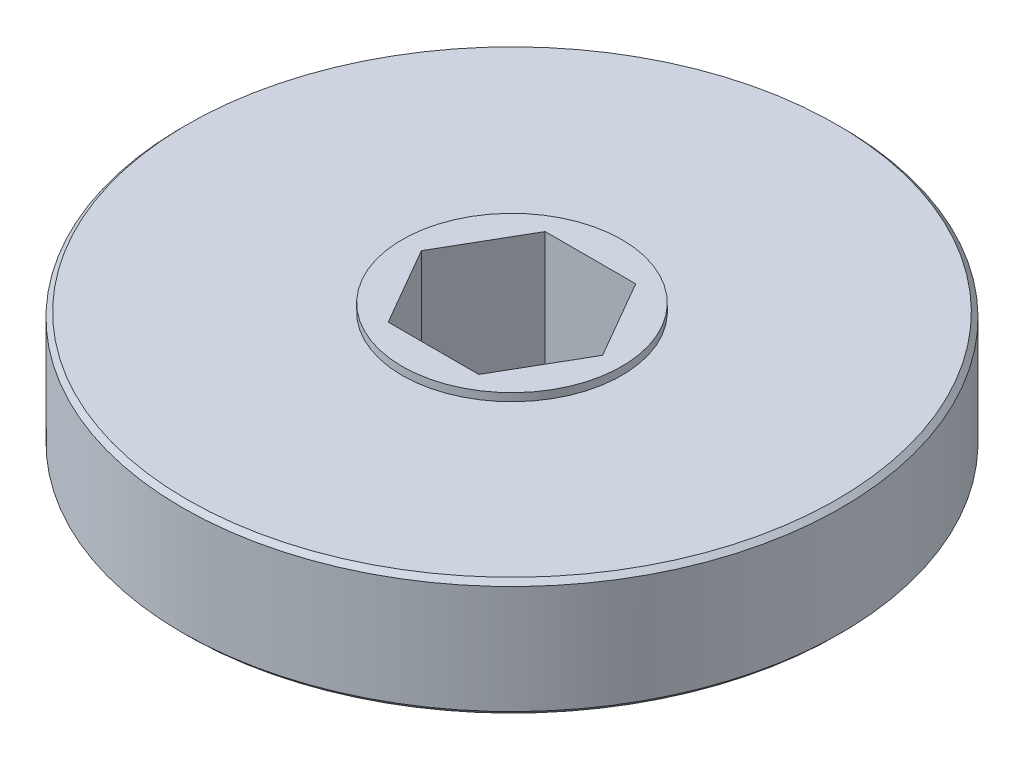
ISO-10303-21;
HEADER;
FILE_DESCRIPTION(('STEP AP214'),'2;1');
FILE_NAME('part.step','',(''),(''),'','','');
FILE_SCHEMA(('AUTOMOTIVE_DESIGN { 1 0 10303 214 1 1 1 1 }'));
ENDSEC;
DATA;
#1=APPLICATION_CONTEXT('core data for automotive mechanical design processes');
#2=APPLICATION_PROTOCOL_DEFINITION('international standard','automotive_design',2000,#1);
#3=PRODUCT_CONTEXT('',#1,'mechanical');
#4=PRODUCT('Part','Part','',(#3));
#5=PRODUCT_RELATED_PRODUCT_CATEGORY('part','',(#4));
#6=PRODUCT_DEFINITION_FORMATION('','',#4);
#7=PRODUCT_DEFINITION_CONTEXT('part definition',#1,'design');
#8=PRODUCT_DEFINITION('design','',#6,#7);
#9=PRODUCT_DEFINITION_SHAPE('','',#8);
#10=(LENGTH_UNIT() NAMED_UNIT(*) SI_UNIT(.MILLI.,.METRE.));
#11=(NAMED_UNIT(*) PLANE_ANGLE_UNIT() SI_UNIT($,.RADIAN.));
#12=(NAMED_UNIT(*) SI_UNIT($,.STERADIAN.) SOLID_ANGLE_UNIT());
#13=UNCERTAINTY_MEASURE_WITH_UNIT(LENGTH_MEASURE(1.E-05),#10,'distance_accuracy_value','');
#14=(GEOMETRIC_REPRESENTATION_CONTEXT(3) GLOBAL_UNCERTAINTY_ASSIGNED_CONTEXT((#13)) GLOBAL_UNIT_ASSIGNED_CONTEXT((#10,
#11,#12)) REPRESENTATION_CONTEXT('',''));
#15=CARTESIAN_POINT('',(0.,0.,0.));
#16=DIRECTION('',(0.,0.,1.));
#17=DIRECTION('',(1.,0.,0.));
#18=AXIS2_PLACEMENT_3D('',#15,#16,#17);
#19=CARTESIAN_POINT('',(0.,-10.16,0.));
#20=DIRECTION('',(0.,1.,0.));
#21=DIRECTION('',(0.,0.,1.));
#22=AXIS2_PLACEMENT_3D('',#19,#20,#21);
#23=CYLINDRICAL_SURFACE('',#22,26.67);
#24=CARTESIAN_POINT('',(0.,-9.77900000000004,0.));
#25=DIRECTION('',(0.,-1.,0.));
#26=DIRECTION('',(0.,0.,-1.));
#27=AXIS2_PLACEMENT_3D('',#24,#25,#26);
#28=CIRCLE('',#27,26.67);
#29=CARTESIAN_POINT('',(0.,-9.77900000000004,-26.67));
#30=VERTEX_POINT('',#29);
#31=EDGE_CURVE('E149',#30,#30,#28,.F.);
#32=ORIENTED_EDGE('',*,*,#31,.T.);
#33=EDGE_LOOP('',(#32));
#34=FACE_BOUND('',#33,.T.);
#35=CARTESIAN_POINT('',(0.,-1.016,0.));
#36=DIRECTION('',(0.,1.,0.));
#37=DIRECTION('',(0.,0.,1.));
#38=AXIS2_PLACEMENT_3D('',#35,#36,#37);
#39=CIRCLE('',#38,26.67);
#40=CARTESIAN_POINT('',(0.,-1.016,26.67));
#41=VERTEX_POINT('',#40);
#42=EDGE_CURVE('E144',#41,#41,#39,.F.);
#43=ORIENTED_EDGE('',*,*,#42,.T.);
#44=EDGE_LOOP('',(#43));
#45=FACE_BOUND('',#44,.T.);
#46=ADVANCED_FACE('F35',(#34,#45),#23,.T.);
#47=CARTESIAN_POINT('',(26.67,-10.16,0.));
#48=DIRECTION('',(0.,-1.,0.));
#49=DIRECTION('',(0.,0.,-1.));
#50=AXIS2_PLACEMENT_3D('',#47,#48,#49);
#51=PLANE('',#50);
#52=CARTESIAN_POINT('',(0.,-10.16,0.));
#53=DIRECTION('',(0.,-1.,0.));
#54=DIRECTION('',(0.,0.,-1.));
#55=AXIS2_PLACEMENT_3D('',#52,#53,#54);
#56=CIRCLE('',#55,26.289);
#57=CARTESIAN_POINT('',(0.,-10.16,-26.289));
#58=VERTEX_POINT('',#57);
#59=EDGE_CURVE('E43',#58,#58,#56,.T.);
#60=ORIENTED_EDGE('',*,*,#59,.T.);
#61=EDGE_LOOP('',(#60));
#62=FACE_BOUND('',#61,.T.);
#63=DIRECTION('',(-0.5,0.,-0.866025403784439));
#64=VECTOR('',#63,1.);
#65=CARTESIAN_POINT('',(-3.66617420935413,-10.16,6.35));
#66=LINE('',#65,#64);
#67=CARTESIAN_POINT('',(-3.66617420935413,-10.16,6.35));
#68=VERTEX_POINT('',#67);
#69=CARTESIAN_POINT('',(-7.33234841870825,-10.16,0.));
#70=VERTEX_POINT('',#69);
#71=EDGE_CURVE('E50',#68,#70,#66,.T.);
#72=ORIENTED_EDGE('',*,*,#71,.F.);
#73=DIRECTION('',(-1.,0.,0.));
#74=VECTOR('',#73,1.);
#75=CARTESIAN_POINT('',(3.66617420935412,-10.16,6.35));
#76=LINE('',#75,#74);
#77=CARTESIAN_POINT('',(3.66617420935412,-10.16,6.35));
#78=VERTEX_POINT('',#77);
#79=EDGE_CURVE('E107',#78,#68,#76,.T.);
#80=ORIENTED_EDGE('',*,*,#79,.F.);
#81=DIRECTION('',(-0.5,0.,0.866025403784439));
#82=VECTOR('',#81,1.);
#83=CARTESIAN_POINT('',(7.33234841870824,-10.16,0.));
#84=LINE('',#83,#82);
#85=CARTESIAN_POINT('',(7.33234841870824,-10.16,0.));
#86=VERTEX_POINT('',#85);
#87=EDGE_CURVE('E110',#86,#78,#84,.T.);
#88=ORIENTED_EDGE('',*,*,#87,.F.);
#89=DIRECTION('',(0.5,0.,0.866025403784438));
#90=VECTOR('',#89,1.);
#91=CARTESIAN_POINT('',(3.66617420935412,-10.16,-6.35));
#92=LINE('',#91,#90);
#93=CARTESIAN_POINT('',(3.66617420935412,-10.16,-6.35));
#94=VERTEX_POINT('',#93);
#95=EDGE_CURVE('E126',#94,#86,#92,.T.);
#96=ORIENTED_EDGE('',*,*,#95,.F.);
#97=DIRECTION('',(1.,0.,0.));
#98=VECTOR('',#97,1.);
#99=CARTESIAN_POINT('',(-3.66617420935412,-10.16,-6.35));
#100=LINE('',#99,#98);
#101=CARTESIAN_POINT('',(-3.66617420935412,-10.16,-6.35));
#102=VERTEX_POINT('',#101);
#103=EDGE_CURVE('E123',#102,#94,#100,.T.);
#104=ORIENTED_EDGE('',*,*,#103,.F.);
#105=DIRECTION('',(0.5,0.,-0.866025403784439));
#106=VECTOR('',#105,1.);
#107=CARTESIAN_POINT('',(-7.33234841870825,-10.16,0.));
#108=LINE('',#107,#106);
#109=EDGE_CURVE('E121',#70,#102,#108,.T.);
#110=ORIENTED_EDGE('',*,*,#109,.F.);
#111=EDGE_LOOP('',(#72,#80,#88,#96,#104,#110));
#112=FACE_BOUND('',#111,.T.);
#113=ADVANCED_FACE('F154',(#62,#112),#51,.T.);
#114=CARTESIAN_POINT('',(0.,-0.635000000000002,0.));
#115=DIRECTION('',(0.,1.,0.));
#116=DIRECTION('',(0.,0.,1.));
#117=AXIS2_PLACEMENT_3D('',#114,#115,#116);
#118=PLANE('',#117);
#119=CARTESIAN_POINT('',(0.,-0.635000000000002,0.));
#120=DIRECTION('',(0.,1.,0.));
#121=DIRECTION('',(0.,0.,1.));
#122=AXIS2_PLACEMENT_3D('',#119,#120,#121);
#123=CIRCLE('',#122,26.289);
#124=CARTESIAN_POINT('',(0.,-0.635000000000002,26.289));
#125=VERTEX_POINT('',#124);
#126=EDGE_CURVE('E11',#125,#125,#123,.T.);
#127=ORIENTED_EDGE('',*,*,#126,.T.);
#128=EDGE_LOOP('',(#127));
#129=FACE_BOUND('',#128,.T.);
#130=CARTESIAN_POINT('',(0.,-0.635000000000002,0.));
#131=DIRECTION('',(0.,1.,0.));
#132=DIRECTION('',(0.,0.,1.));
#133=AXIS2_PLACEMENT_3D('',#130,#131,#132);
#134=CIRCLE('',#133,8.89);
#135=CARTESIAN_POINT('',(0.,-0.635000000000002,8.89));
#136=VERTEX_POINT('',#135);
#137=EDGE_CURVE('E133',#136,#136,#134,.T.);
#138=ORIENTED_EDGE('',*,*,#137,.F.);
#139=EDGE_LOOP('',(#138));
#140=FACE_BOUND('',#139,.T.);
#141=ADVANCED_FACE('F171',(#129,#140),#118,.T.);
#142=CARTESIAN_POINT('',(0.,0.,0.));
#143=DIRECTION('',(0.,-1.,0.));
#144=DIRECTION('',(0.,0.,-1.));
#145=AXIS2_PLACEMENT_3D('',#142,#143,#144);
#146=CYLINDRICAL_SURFACE('',#145,8.89);
#147=CARTESIAN_POINT('',(0.,0.,0.));
#148=DIRECTION('',(0.,1.,0.));
#149=DIRECTION('',(0.,0.,1.));
#150=AXIS2_PLACEMENT_3D('',#147,#148,#149);
#151=CIRCLE('',#150,8.89);
#152=CARTESIAN_POINT('',(0.,0.,8.89));
#153=VERTEX_POINT('',#152);
#154=EDGE_CURVE('E141',#153,#153,#151,.T.);
#155=ORIENTED_EDGE('',*,*,#154,.F.);
#156=EDGE_LOOP('',(#155));
#157=FACE_BOUND('',#156,.T.);
#158=ORIENTED_EDGE('',*,*,#137,.T.);
#159=EDGE_LOOP('',(#158));
#160=FACE_BOUND('',#159,.T.);
#161=ADVANCED_FACE('F174',(#157,#160),#146,.T.);
#162=CARTESIAN_POINT('',(0.,0.,0.));
#163=DIRECTION('',(0.,1.,0.));
#164=DIRECTION('',(0.,0.,1.));
#165=AXIS2_PLACEMENT_3D('',#162,#163,#164);
#166=PLANE('',#165);
#167=DIRECTION('',(-0.5,0.,-0.866025403784439));
#168=VECTOR('',#167,1.);
#169=CARTESIAN_POINT('',(-3.66617420935413,0.,6.35));
#170=LINE('',#169,#168);
#171=CARTESIAN_POINT('',(-3.66617420935413,0.,6.35));
#172=VERTEX_POINT('',#171);
#173=CARTESIAN_POINT('',(-7.33234841870825,0.,0.));
#174=VERTEX_POINT('',#173);
#175=EDGE_CURVE('E90',#172,#174,#170,.T.);
#176=ORIENTED_EDGE('',*,*,#175,.T.);
#177=DIRECTION('',(0.5,0.,-0.866025403784439));
#178=VECTOR('',#177,1.);
#179=CARTESIAN_POINT('',(-7.33234841870825,0.,0.));
#180=LINE('',#179,#178);
#181=CARTESIAN_POINT('',(-3.66617420935412,0.,-6.35));
#182=VERTEX_POINT('',#181);
#183=EDGE_CURVE('E99',#174,#182,#180,.T.);
#184=ORIENTED_EDGE('',*,*,#183,.T.);
#185=DIRECTION('',(1.,0.,0.));
#186=VECTOR('',#185,1.);
#187=CARTESIAN_POINT('',(-3.66617420935412,0.,-6.35));
#188=LINE('',#187,#186);
#189=CARTESIAN_POINT('',(3.66617420935412,0.,-6.35));
#190=VERTEX_POINT('',#189);
#191=EDGE_CURVE('E58',#182,#190,#188,.T.);
#192=ORIENTED_EDGE('',*,*,#191,.T.);
#193=DIRECTION('',(0.5,0.,0.866025403784438));
#194=VECTOR('',#193,1.);
#195=CARTESIAN_POINT('',(3.66617420935412,0.,-6.35));
#196=LINE('',#195,#194);
#197=CARTESIAN_POINT('',(7.33234841870824,0.,0.));
#198=VERTEX_POINT('',#197);
#199=EDGE_CURVE('E114',#190,#198,#196,.T.);
#200=ORIENTED_EDGE('',*,*,#199,.T.);
#201=DIRECTION('',(-0.5,0.,0.866025403784439));
#202=VECTOR('',#201,1.);
#203=CARTESIAN_POINT('',(7.33234841870824,0.,0.));
#204=LINE('',#203,#202);
#205=CARTESIAN_POINT('',(3.66617420935412,0.,6.35));
#206=VERTEX_POINT('',#205);
#207=EDGE_CURVE('E117',#198,#206,#204,.T.);
#208=ORIENTED_EDGE('',*,*,#207,.T.);
#209=DIRECTION('',(-1.,0.,0.));
#210=VECTOR('',#209,1.);
#211=CARTESIAN_POINT('',(3.66617420935412,0.,6.35));
#212=LINE('',#211,#210);
#213=EDGE_CURVE('E96',#206,#172,#212,.T.);
#214=ORIENTED_EDGE('',*,*,#213,.T.);
#215=EDGE_LOOP('',(#176,#184,#192,#200,#208,#214));
#216=FACE_BOUND('',#215,.T.);
#217=ORIENTED_EDGE('',*,*,#154,.T.);
#218=EDGE_LOOP('',(#217));
#219=FACE_BOUND('',#218,.T.);
#220=ADVANCED_FACE('F103',(#216,#219),#166,.T.);
#221=CARTESIAN_POINT('',(-3.66617420935413,0.,6.35));
#222=DIRECTION('',(-0.866025403784439,0.,0.5));
#223=DIRECTION('',(0.5,0.,0.866025403784439));
#224=AXIS2_PLACEMENT_3D('',#221,#222,#223);
#225=PLANE('',#224);
#226=ORIENTED_EDGE('',*,*,#71,.T.);
#227=DIRECTION('',(0.,-1.,0.));
#228=VECTOR('',#227,1.);
#229=CARTESIAN_POINT('',(-7.33234841870825,0.,0.));
#230=LINE('',#229,#228);
#231=EDGE_CURVE('E86',#174,#70,#230,.T.);
#232=ORIENTED_EDGE('',*,*,#231,.F.);
#233=ORIENTED_EDGE('',*,*,#175,.F.);
#234=DIRECTION('',(0.,-1.,0.));
#235=VECTOR('',#234,1.);
#236=CARTESIAN_POINT('',(-3.66617420935413,0.,6.35));
#237=LINE('',#236,#235);
#238=EDGE_CURVE('E131',#172,#68,#237,.T.);
#239=ORIENTED_EDGE('',*,*,#238,.T.);
#240=EDGE_LOOP('',(#226,#232,#233,#239));
#241=FACE_BOUND('',#240,.T.);
#242=ADVANCED_FACE('F88',(#241),#225,.F.);
#243=CARTESIAN_POINT('',(3.66617420935412,0.,6.35));
#244=DIRECTION('',(0.,0.,1.));
#245=DIRECTION('',(1.,0.,0.));
#246=AXIS2_PLACEMENT_3D('',#243,#244,#245);
#247=PLANE('',#246);
#248=ORIENTED_EDGE('',*,*,#79,.T.);
#249=ORIENTED_EDGE('',*,*,#238,.F.);
#250=ORIENTED_EDGE('',*,*,#213,.F.);
#251=DIRECTION('',(0.,-1.,0.));
#252=VECTOR('',#251,1.);
#253=CARTESIAN_POINT('',(3.66617420935412,0.,6.35));
#254=LINE('',#253,#252);
#255=EDGE_CURVE('E134',#206,#78,#254,.T.);
#256=ORIENTED_EDGE('',*,*,#255,.T.);
#257=EDGE_LOOP('',(#248,#249,#250,#256));
#258=FACE_BOUND('',#257,.T.);
#259=ADVANCED_FACE('F240',(#258),#247,.F.);
#260=CARTESIAN_POINT('',(7.33234841870824,0.,0.));
#261=DIRECTION('',(0.866025403784439,0.,0.5));
#262=DIRECTION('',(0.5,0.,-0.866025403784439));
#263=AXIS2_PLACEMENT_3D('',#260,#261,#262);
#264=PLANE('',#263);
#265=ORIENTED_EDGE('',*,*,#87,.T.);
#266=ORIENTED_EDGE('',*,*,#255,.F.);
#267=ORIENTED_EDGE('',*,*,#207,.F.);
#268=DIRECTION('',(0.,-1.,0.));
#269=VECTOR('',#268,1.);
#270=CARTESIAN_POINT('',(7.33234841870824,0.,0.));
#271=LINE('',#270,#269);
#272=EDGE_CURVE('E136',#198,#86,#271,.T.);
#273=ORIENTED_EDGE('',*,*,#272,.T.);
#274=EDGE_LOOP('',(#265,#266,#267,#273));
#275=FACE_BOUND('',#274,.T.);
#276=ADVANCED_FACE('F232',(#275),#264,.F.);
#277=CARTESIAN_POINT('',(3.66617420935412,0.,-6.35));
#278=DIRECTION('',(0.866025403784439,0.,-0.5));
#279=DIRECTION('',(-0.5,0.,-0.866025403784439));
#280=AXIS2_PLACEMENT_3D('',#277,#278,#279);
#281=PLANE('',#280);
#282=ORIENTED_EDGE('',*,*,#95,.T.);
#283=ORIENTED_EDGE('',*,*,#272,.F.);
#284=ORIENTED_EDGE('',*,*,#199,.F.);
#285=DIRECTION('',(0.,-1.,0.));
#286=VECTOR('',#285,1.);
#287=CARTESIAN_POINT('',(3.66617420935412,0.,-6.35));
#288=LINE('',#287,#286);
#289=EDGE_CURVE('E138',#190,#94,#288,.T.);
#290=ORIENTED_EDGE('',*,*,#289,.T.);
#291=EDGE_LOOP('',(#282,#283,#284,#290));
#292=FACE_BOUND('',#291,.T.);
#293=ADVANCED_FACE('F225',(#292),#281,.F.);
#294=CARTESIAN_POINT('',(-3.66617420935412,0.,-6.35));
#295=DIRECTION('',(0.,0.,-1.));
#296=DIRECTION('',(-1.,0.,0.));
#297=AXIS2_PLACEMENT_3D('',#294,#295,#296);
#298=PLANE('',#297);
#299=ORIENTED_EDGE('',*,*,#103,.T.);
#300=ORIENTED_EDGE('',*,*,#289,.F.);
#301=ORIENTED_EDGE('',*,*,#191,.F.);
#302=DIRECTION('',(0.,-1.,0.));
#303=VECTOR('',#302,1.);
#304=CARTESIAN_POINT('',(-3.66617420935412,0.,-6.35));
#305=LINE('',#304,#303);
#306=EDGE_CURVE('E95',#182,#102,#305,.T.);
#307=ORIENTED_EDGE('',*,*,#306,.T.);
#308=EDGE_LOOP('',(#299,#300,#301,#307));
#309=FACE_BOUND('',#308,.T.);
#310=ADVANCED_FACE('F219',(#309),#298,.F.);
#311=CARTESIAN_POINT('',(-7.33234841870825,0.,0.));
#312=DIRECTION('',(-0.866025403784439,0.,-0.5));
#313=DIRECTION('',(-0.5,0.,0.866025403784439));
#314=AXIS2_PLACEMENT_3D('',#311,#312,#313);
#315=PLANE('',#314);
#316=ORIENTED_EDGE('',*,*,#109,.T.);
#317=ORIENTED_EDGE('',*,*,#306,.F.);
#318=ORIENTED_EDGE('',*,*,#183,.F.);
#319=ORIENTED_EDGE('',*,*,#231,.T.);
#320=EDGE_LOOP('',(#316,#317,#318,#319));
#321=FACE_BOUND('',#320,.T.);
#322=ADVANCED_FACE('F100',(#321),#315,.F.);
#323=CARTESIAN_POINT('',(0.,-9.77900000000004,0.));
#324=DIRECTION('',(0.,1.,0.));
#325=DIRECTION('',(0.,0.,1.));
#326=AXIS2_PLACEMENT_3D('',#323,#324,#325);
#327=CONICAL_SURFACE('',#326,26.67,0.785398163397471);
#328=ORIENTED_EDGE('',*,*,#59,.F.);
#329=EDGE_LOOP('',(#328));
#330=FACE_BOUND('',#329,.T.);
#331=ORIENTED_EDGE('',*,*,#31,.F.);
#332=EDGE_LOOP('',(#331));
#333=FACE_BOUND('',#332,.T.);
#334=ADVANCED_FACE('F157',(#330,#333),#327,.T.);
#335=CARTESIAN_POINT('',(0.,-0.635000000000002,0.));
#336=DIRECTION('',(0.,-1.,0.));
#337=DIRECTION('',(0.,0.,-1.));
#338=AXIS2_PLACEMENT_3D('',#335,#336,#337);
#339=CONICAL_SURFACE('',#338,26.289,0.785398163397435);
#340=ORIENTED_EDGE('',*,*,#42,.F.);
#341=EDGE_LOOP('',(#340));
#342=FACE_BOUND('',#341,.T.);
#343=ORIENTED_EDGE('',*,*,#126,.F.);
#344=EDGE_LOOP('',(#343));
#345=FACE_BOUND('',#344,.T.);
#346=ADVANCED_FACE('F37',(#342,#345),#339,.T.);
#347=CLOSED_SHELL('',(#46,#113,#141,#161,#220,#242,#259,#276,#293,#310,#322,#334,#346));
#348=MANIFOLD_SOLID_BREP('B2',#347);
#349=ADVANCED_BREP_SHAPE_REPRESENTATION('',(#18,#348),#14);
#350=SHAPE_DEFINITION_REPRESENTATION(#9,#349);
ENDSEC;
END-ISO-10303-21;
